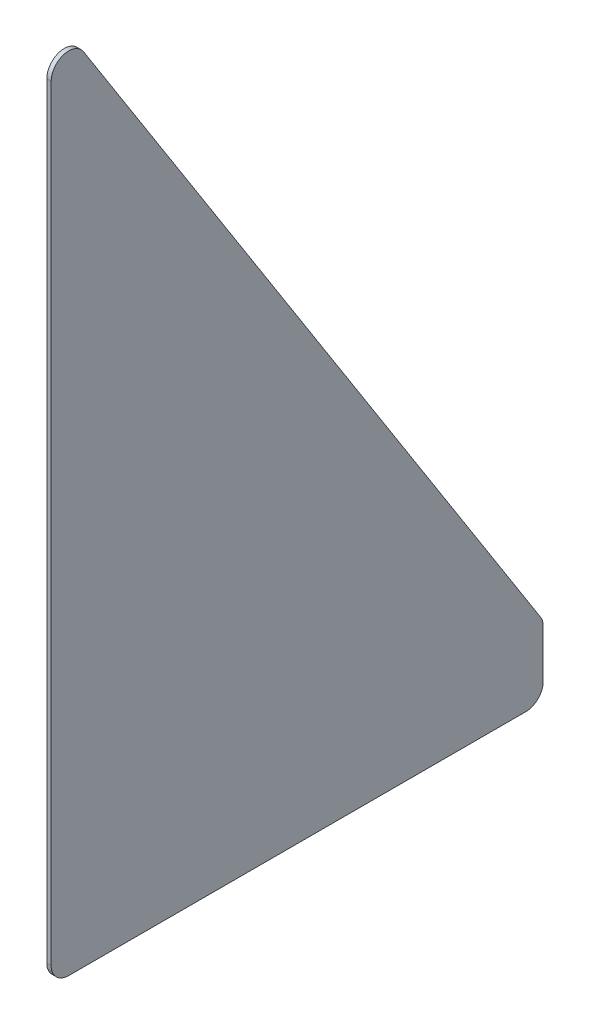
ISO-10303-21;
HEADER;
FILE_DESCRIPTION(('STEP AP214'),'2;1');
FILE_NAME('part.step','',(''),(''),'','','');
FILE_SCHEMA(('AUTOMOTIVE_DESIGN { 1 0 10303 214 1 1 1 1 }'));
ENDSEC;
DATA;
#1=APPLICATION_CONTEXT('core data for automotive mechanical design processes');
#2=APPLICATION_PROTOCOL_DEFINITION('international standard','automotive_design',2000,#1);
#3=PRODUCT_CONTEXT('',#1,'mechanical');
#4=PRODUCT('Part','Part','',(#3));
#5=PRODUCT_RELATED_PRODUCT_CATEGORY('part','',(#4));
#6=PRODUCT_DEFINITION_FORMATION('','',#4);
#7=PRODUCT_DEFINITION_CONTEXT('part definition',#1,'design');
#8=PRODUCT_DEFINITION('design','',#6,#7);
#9=PRODUCT_DEFINITION_SHAPE('','',#8);
#10=(LENGTH_UNIT() NAMED_UNIT(*) SI_UNIT(.MILLI.,.METRE.));
#11=(NAMED_UNIT(*) PLANE_ANGLE_UNIT() SI_UNIT($,.RADIAN.));
#12=(NAMED_UNIT(*) SI_UNIT($,.STERADIAN.) SOLID_ANGLE_UNIT());
#13=UNCERTAINTY_MEASURE_WITH_UNIT(LENGTH_MEASURE(1.E-05),#10,'distance_accuracy_value','');
#14=(GEOMETRIC_REPRESENTATION_CONTEXT(3) GLOBAL_UNCERTAINTY_ASSIGNED_CONTEXT((#13)) GLOBAL_UNIT_ASSIGNED_CONTEXT((#10,
#11,#12)) REPRESENTATION_CONTEXT('',''));
#15=CARTESIAN_POINT('',(0.,0.,0.));
#16=DIRECTION('',(0.,0.,1.));
#17=DIRECTION('',(1.,0.,0.));
#18=AXIS2_PLACEMENT_3D('',#15,#16,#17);
#19=CARTESIAN_POINT('',(1.58750000000002,304.8,0.));
#20=DIRECTION('',(0.,0.,-1.));
#21=DIRECTION('',(-1.,0.,0.));
#22=AXIS2_PLACEMENT_3D('',#19,#20,#21);
#23=PLANE('',#22);
#24=DIRECTION('',(0.,-1.,0.));
#25=VECTOR('',#24,1.);
#26=CARTESIAN_POINT('',(0.,304.8,0.));
#27=LINE('',#26,#25);
#28=CARTESIAN_POINT('',(0.,282.993732779132,0.));
#29=VERTEX_POINT('',#28);
#30=CARTESIAN_POINT('',(0.,6.35000000000013,0.));
#31=VERTEX_POINT('',#30);
#32=EDGE_CURVE('E124',#29,#31,#27,.T.);
#33=ORIENTED_EDGE('',*,*,#32,.T.);
#34=DIRECTION('',(1.,0.,0.));
#35=VECTOR('',#34,1.);
#36=CARTESIAN_POINT('',(1.58750000000002,6.35000000000002,0.));
#37=LINE('',#36,#35);
#38=CARTESIAN_POINT('',(1.58750000000002,6.35000000000013,0.));
#39=VERTEX_POINT('',#38);
#40=EDGE_CURVE('E150',#31,#39,#37,.T.);
#41=ORIENTED_EDGE('',*,*,#40,.T.);
#42=DIRECTION('',(0.,-1.,0.));
#43=VECTOR('',#42,1.);
#44=CARTESIAN_POINT('',(1.58750000000002,304.8,0.));
#45=LINE('',#44,#43);
#46=CARTESIAN_POINT('',(1.58750000000002,282.993732779132,0.));
#47=VERTEX_POINT('',#46);
#48=EDGE_CURVE('E128',#47,#39,#45,.T.);
#49=ORIENTED_EDGE('',*,*,#48,.F.);
#50=DIRECTION('',(1.,0.,0.));
#51=VECTOR('',#50,1.);
#52=CARTESIAN_POINT('',(1.5875000000002,282.993732779132,0.));
#53=LINE('',#52,#51);
#54=EDGE_CURVE('E148',#47,#29,#53,.F.);
#55=ORIENTED_EDGE('',*,*,#54,.T.);
#56=EDGE_LOOP('',(#33,#41,#49,#55));
#57=FACE_BOUND('',#56,.T.);
#58=ADVANCED_FACE('F36',(#57),#23,.F.);
#59=CARTESIAN_POINT('',(1.5875,304.8,-177.8));
#60=DIRECTION('',(-1.,0.,0.));
#61=DIRECTION('',(0.,0.,1.));
#62=AXIS2_PLACEMENT_3D('',#59,#60,#61);
#63=PLANE('',#62);
#64=DIRECTION('',(0.,0.,-1.));
#65=VECTOR('',#64,1.);
#66=CARTESIAN_POINT('',(1.5875,0.,-177.8));
#67=LINE('',#66,#65);
#68=CARTESIAN_POINT('',(1.58750000000002,0.,-6.34999999999999));
#69=VERTEX_POINT('',#68);
#70=CARTESIAN_POINT('',(1.5875,0.,-171.45));
#71=VERTEX_POINT('',#70);
#72=EDGE_CURVE('E156',#69,#71,#67,.T.);
#73=ORIENTED_EDGE('',*,*,#72,.T.);
#74=CARTESIAN_POINT('',(1.5875,6.35000000000002,-171.45));
#75=DIRECTION('',(-1.,0.,0.));
#76=DIRECTION('',(0.,0.,1.));
#77=AXIS2_PLACEMENT_3D('',#74,#75,#76);
#78=CIRCLE('',#77,6.35);
#79=CARTESIAN_POINT('',(1.5875,6.35000000000013,-177.8));
#80=VERTEX_POINT('',#79);
#81=EDGE_CURVE('E146',#71,#80,#78,.F.);
#82=ORIENTED_EDGE('',*,*,#81,.T.);
#83=DIRECTION('',(0.,-1.,0.));
#84=VECTOR('',#83,1.);
#85=CARTESIAN_POINT('',(1.5875,304.8,-177.8));
#86=LINE('',#85,#84);
#87=CARTESIAN_POINT('',(1.5875,23.5508756362753,-177.8));
#88=VERTEX_POINT('',#87);
#89=EDGE_CURVE('E123',#88,#80,#86,.T.);
#90=ORIENTED_EDGE('',*,*,#89,.F.);
#91=CARTESIAN_POINT('',(1.58750000000002,23.5508756362752,-171.45));
#92=DIRECTION('',(-1.,0.,0.));
#93=DIRECTION('',(0.,0.,1.));
#94=AXIS2_PLACEMENT_3D('',#91,#92,#93);
#95=CIRCLE('',#94,6.35);
#96=CARTESIAN_POINT('',(1.58750000000002,26.9600350117017,-176.807250447099));
#97=VERTEX_POINT('',#96);
#98=EDGE_CURVE('E127',#88,#97,#95,.F.);
#99=ORIENTED_EDGE('',*,*,#98,.T.);
#100=DIRECTION('',(0.,-0.843661487732108,-0.536875492193159));
#101=VECTOR('',#100,1.);
#102=CARTESIAN_POINT('',(1.58750000000002,25.3999999999995,-177.8));
#103=LINE('',#102,#101);
#104=CARTESIAN_POINT('',(1.58750000000003,286.402892154559,-11.7072504470989));
#105=VERTEX_POINT('',#104);
#106=EDGE_CURVE('E155',#105,#97,#103,.T.);
#107=ORIENTED_EDGE('',*,*,#106,.F.);
#108=CARTESIAN_POINT('',(1.58750000000002,282.993732779132,-6.35));
#109=DIRECTION('',(-1.,0.,0.));
#110=DIRECTION('',(0.,0.,1.));
#111=AXIS2_PLACEMENT_3D('',#108,#109,#110);
#112=CIRCLE('',#111,6.35);
#113=EDGE_CURVE('E59',#105,#47,#112,.F.);
#114=ORIENTED_EDGE('',*,*,#113,.T.);
#115=ORIENTED_EDGE('',*,*,#48,.T.);
#116=CARTESIAN_POINT('',(1.58750000000002,6.35000000000002,-6.35));
#117=DIRECTION('',(-1.,0.,0.));
#118=DIRECTION('',(0.,0.,1.));
#119=AXIS2_PLACEMENT_3D('',#116,#117,#118);
#120=CIRCLE('',#119,6.35);
#121=EDGE_CURVE('E51',#39,#69,#120,.F.);
#122=ORIENTED_EDGE('',*,*,#121,.T.);
#123=EDGE_LOOP('',(#73,#82,#90,#99,#107,#114,#115,#122));
#124=FACE_BOUND('',#123,.T.);
#125=ADVANCED_FACE('F189',(#124),#63,.F.);
#126=CARTESIAN_POINT('',(0.,304.8,-177.8));
#127=DIRECTION('',(0.,0.,1.));
#128=DIRECTION('',(1.,0.,0.));
#129=AXIS2_PLACEMENT_3D('',#126,#127,#128);
#130=PLANE('',#129);
#131=ORIENTED_EDGE('',*,*,#89,.T.);
#132=DIRECTION('',(-1.,0.,0.));
#133=VECTOR('',#132,1.);
#134=CARTESIAN_POINT('',(0.,6.35000000000002,-177.8));
#135=LINE('',#134,#133);
#136=CARTESIAN_POINT('',(0.,6.35000000000013,-177.8));
#137=VERTEX_POINT('',#136);
#138=EDGE_CURVE('E114',#80,#137,#135,.T.);
#139=ORIENTED_EDGE('',*,*,#138,.T.);
#140=DIRECTION('',(0.,-1.,0.));
#141=VECTOR('',#140,1.);
#142=CARTESIAN_POINT('',(0.,304.8,-177.8));
#143=LINE('',#142,#141);
#144=CARTESIAN_POINT('',(0.,23.5508756362752,-177.8));
#145=VERTEX_POINT('',#144);
#146=EDGE_CURVE('E106',#145,#137,#143,.T.);
#147=ORIENTED_EDGE('',*,*,#146,.F.);
#148=DIRECTION('',(-1.,0.,0.));
#149=VECTOR('',#148,1.);
#150=CARTESIAN_POINT('',(9.24271214463401E-12,23.5508756362751,-177.8));
#151=LINE('',#150,#149);
#152=EDGE_CURVE('E120',#145,#88,#151,.F.);
#153=ORIENTED_EDGE('',*,*,#152,.T.);
#154=EDGE_LOOP('',(#131,#139,#147,#153));
#155=FACE_BOUND('',#154,.T.);
#156=ADVANCED_FACE('F119',(#155),#130,.F.);
#157=CARTESIAN_POINT('',(0.,304.8,0.));
#158=DIRECTION('',(1.,0.,0.));
#159=DIRECTION('',(0.,0.,-1.));
#160=AXIS2_PLACEMENT_3D('',#157,#158,#159);
#161=PLANE('',#160);
#162=ORIENTED_EDGE('',*,*,#146,.T.);
#163=CARTESIAN_POINT('',(0.,6.35000000000002,-171.45));
#164=DIRECTION('',(1.,0.,0.));
#165=DIRECTION('',(0.,0.,-1.));
#166=AXIS2_PLACEMENT_3D('',#163,#164,#165);
#167=CIRCLE('',#166,6.35);
#168=CARTESIAN_POINT('',(0.,0.,-171.45));
#169=VERTEX_POINT('',#168);
#170=EDGE_CURVE('E137',#137,#169,#167,.F.);
#171=ORIENTED_EDGE('',*,*,#170,.T.);
#172=DIRECTION('',(0.,0.,1.));
#173=VECTOR('',#172,1.);
#174=CARTESIAN_POINT('',(0.,0.,0.));
#175=LINE('',#174,#173);
#176=CARTESIAN_POINT('',(0.,0.,-6.35));
#177=VERTEX_POINT('',#176);
#178=EDGE_CURVE('E159',#169,#177,#175,.T.);
#179=ORIENTED_EDGE('',*,*,#178,.T.);
#180=CARTESIAN_POINT('',(0.,6.35000000000002,-6.35));
#181=DIRECTION('',(1.,0.,0.));
#182=DIRECTION('',(0.,0.,-1.));
#183=AXIS2_PLACEMENT_3D('',#180,#181,#182);
#184=CIRCLE('',#183,6.35);
#185=EDGE_CURVE('E135',#177,#31,#184,.F.);
#186=ORIENTED_EDGE('',*,*,#185,.T.);
#187=ORIENTED_EDGE('',*,*,#32,.F.);
#188=CARTESIAN_POINT('',(0.,282.993732779132,-6.35000000000001));
#189=DIRECTION('',(1.,0.,0.));
#190=DIRECTION('',(0.,0.,-1.));
#191=AXIS2_PLACEMENT_3D('',#188,#189,#190);
#192=CIRCLE('',#191,6.35);
#193=CARTESIAN_POINT('',(0.,286.402892154559,-11.7072504470989));
#194=VERTEX_POINT('',#193);
#195=EDGE_CURVE('E113',#29,#194,#192,.F.);
#196=ORIENTED_EDGE('',*,*,#195,.T.);
#197=DIRECTION('',(0.,0.843661487732108,0.536875492193159));
#198=VECTOR('',#197,1.);
#199=CARTESIAN_POINT('',(-6.09683522952735E-13,25.4,-177.8));
#200=LINE('',#199,#198);
#201=CARTESIAN_POINT('',(-6.06279343847997E-13,26.9600350117017,-176.807250447099));
#202=VERTEX_POINT('',#201);
#203=EDGE_CURVE('E108',#202,#194,#200,.T.);
#204=ORIENTED_EDGE('',*,*,#203,.F.);
#205=CARTESIAN_POINT('',(0.,23.5508756362751,-171.45));
#206=DIRECTION('',(1.,0.,0.));
#207=DIRECTION('',(0.,0.,-1.));
#208=AXIS2_PLACEMENT_3D('',#205,#206,#207);
#209=CIRCLE('',#208,6.35);
#210=EDGE_CURVE('E103',#202,#145,#209,.F.);
#211=ORIENTED_EDGE('',*,*,#210,.T.);
#212=EDGE_LOOP('',(#162,#171,#179,#186,#187,#196,#204,#211));
#213=FACE_BOUND('',#212,.T.);
#214=ADVANCED_FACE('F105',(#213),#161,.F.);
#215=CARTESIAN_POINT('',(0.,0.,0.));
#216=DIRECTION('',(0.,-1.,0.));
#217=DIRECTION('',(0.,0.,-1.));
#218=AXIS2_PLACEMENT_3D('',#215,#216,#217);
#219=PLANE('',#218);
#220=ORIENTED_EDGE('',*,*,#178,.F.);
#221=DIRECTION('',(-1.,0.,0.));
#222=VECTOR('',#221,1.);
#223=CARTESIAN_POINT('',(1.58749999999989,0.,-171.45));
#224=LINE('',#223,#222);
#225=EDGE_CURVE('E141',#169,#71,#224,.F.);
#226=ORIENTED_EDGE('',*,*,#225,.T.);
#227=ORIENTED_EDGE('',*,*,#72,.F.);
#228=DIRECTION('',(1.,0.,0.));
#229=VECTOR('',#228,1.);
#230=CARTESIAN_POINT('',(0.,0.,-6.35));
#231=LINE('',#230,#229);
#232=EDGE_CURVE('E139',#69,#177,#231,.F.);
#233=ORIENTED_EDGE('',*,*,#232,.T.);
#234=EDGE_LOOP('',(#220,#226,#227,#233));
#235=FACE_BOUND('',#234,.T.);
#236=ADVANCED_FACE('F173',(#235),#219,.T.);
#237=CARTESIAN_POINT('',(332.762982184294,25.4,-177.800000000001));
#238=DIRECTION('',(0.,-0.536875492193159,0.843661487732108));
#239=DIRECTION('',(0.,-0.843661487732108,-0.536875492193159));
#240=AXIS2_PLACEMENT_3D('',#237,#238,#239);
#241=PLANE('',#240);
#242=ORIENTED_EDGE('',*,*,#203,.T.);
#243=DIRECTION('',(1.,0.,0.));
#244=VECTOR('',#243,1.);
#245=CARTESIAN_POINT('',(332.762982184292,286.402892154562,-11.7072504470983));
#246=LINE('',#245,#244);
#247=EDGE_CURVE('E11',#194,#105,#246,.T.);
#248=ORIENTED_EDGE('',*,*,#247,.T.);
#249=ORIENTED_EDGE('',*,*,#106,.T.);
#250=DIRECTION('',(-1.,0.,0.));
#251=VECTOR('',#250,1.);
#252=CARTESIAN_POINT('',(332.762982184294,26.9600350117126,-176.807250447093));
#253=LINE('',#252,#251);
#254=EDGE_CURVE('E44',#97,#202,#253,.T.);
#255=ORIENTED_EDGE('',*,*,#254,.T.);
#256=EDGE_LOOP('',(#242,#248,#249,#255));
#257=FACE_BOUND('',#256,.T.);
#258=ADVANCED_FACE('F153',(#257),#241,.F.);
#259=CARTESIAN_POINT('',(-1.11022302462516E-13,6.35000000000002,-171.45));
#260=DIRECTION('',(1.,0.,0.));
#261=DIRECTION('',(0.,0.,-1.));
#262=AXIS2_PLACEMENT_3D('',#259,#260,#261);
#263=CYLINDRICAL_SURFACE('',#262,6.35);
#264=ORIENTED_EDGE('',*,*,#81,.F.);
#265=ORIENTED_EDGE('',*,*,#225,.F.);
#266=ORIENTED_EDGE('',*,*,#170,.F.);
#267=ORIENTED_EDGE('',*,*,#138,.F.);
#268=EDGE_LOOP('',(#264,#265,#266,#267));
#269=FACE_BOUND('',#268,.T.);
#270=ADVANCED_FACE('F168',(#269),#263,.T.);
#271=CARTESIAN_POINT('',(1.58750000000003,6.35000000000002,-6.35));
#272=DIRECTION('',(-1.,0.,0.));
#273=DIRECTION('',(0.,0.,1.));
#274=AXIS2_PLACEMENT_3D('',#271,#272,#273);
#275=CYLINDRICAL_SURFACE('',#274,6.35);
#276=ORIENTED_EDGE('',*,*,#185,.F.);
#277=ORIENTED_EDGE('',*,*,#232,.F.);
#278=ORIENTED_EDGE('',*,*,#121,.F.);
#279=ORIENTED_EDGE('',*,*,#40,.F.);
#280=EDGE_LOOP('',(#276,#277,#278,#279));
#281=FACE_BOUND('',#280,.T.);
#282=ADVANCED_FACE('F175',(#281),#275,.T.);
#283=CARTESIAN_POINT('',(332.762982184292,282.993732779135,-6.34999999999938));
#284=DIRECTION('',(1.,0.,0.));
#285=DIRECTION('',(0.,1.,0.));
#286=AXIS2_PLACEMENT_3D('',#283,#284,#285);
#287=CYLINDRICAL_SURFACE('',#286,6.35);
#288=ORIENTED_EDGE('',*,*,#195,.F.);
#289=ORIENTED_EDGE('',*,*,#54,.F.);
#290=ORIENTED_EDGE('',*,*,#113,.F.);
#291=ORIENTED_EDGE('',*,*,#247,.F.);
#292=EDGE_LOOP('',(#288,#289,#290,#291));
#293=FACE_BOUND('',#292,.T.);
#294=ADVANCED_FACE('F181',(#293),#287,.T.);
#295=CARTESIAN_POINT('',(332.762982184294,23.5508756362861,-171.449999999994));
#296=DIRECTION('',(-1.,0.,0.));
#297=DIRECTION('',(0.,-1.,0.));
#298=AXIS2_PLACEMENT_3D('',#295,#296,#297);
#299=CYLINDRICAL_SURFACE('',#298,6.35);
#300=ORIENTED_EDGE('',*,*,#98,.F.);
#301=ORIENTED_EDGE('',*,*,#152,.F.);
#302=ORIENTED_EDGE('',*,*,#210,.F.);
#303=ORIENTED_EDGE('',*,*,#254,.F.);
#304=EDGE_LOOP('',(#300,#301,#302,#303));
#305=FACE_BOUND('',#304,.T.);
#306=ADVANCED_FACE('F38',(#305),#299,.T.);
#307=CLOSED_SHELL('',(#58,#125,#156,#214,#236,#258,#270,#282,#294,#306));
#308=MANIFOLD_SOLID_BREP('B2',#307);
#309=ADVANCED_BREP_SHAPE_REPRESENTATION('',(#18,#308),#14);
#310=SHAPE_DEFINITION_REPRESENTATION(#9,#309);
ENDSEC;
END-ISO-10303-21;
